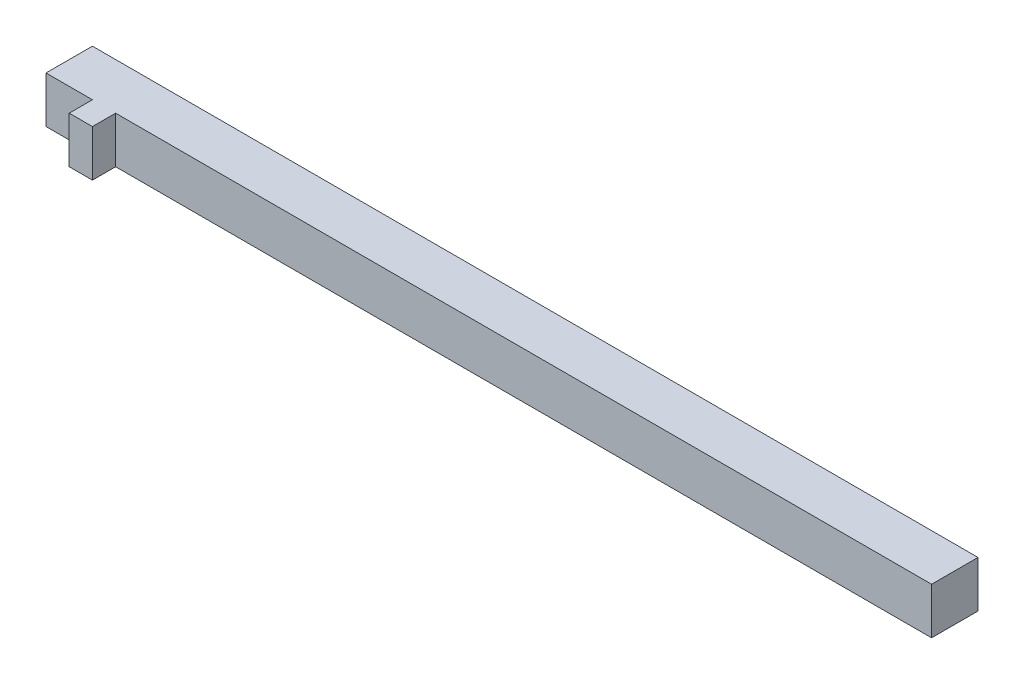
ISO-10303-21;
HEADER;
FILE_DESCRIPTION(('STEP AP214'),'2;1');
FILE_NAME('part.step','',(''),(''),'','','');
FILE_SCHEMA(('AUTOMOTIVE_DESIGN { 1 0 10303 214 1 1 1 1 }'));
ENDSEC;
DATA;
#1=APPLICATION_CONTEXT('core data for automotive mechanical design processes');
#2=APPLICATION_PROTOCOL_DEFINITION('international standard','automotive_design',2000,#1);
#3=PRODUCT_CONTEXT('',#1,'mechanical');
#4=PRODUCT('Part','Part','',(#3));
#5=PRODUCT_RELATED_PRODUCT_CATEGORY('part','',(#4));
#6=PRODUCT_DEFINITION_FORMATION('','',#4);
#7=PRODUCT_DEFINITION_CONTEXT('part definition',#1,'design');
#8=PRODUCT_DEFINITION('design','',#6,#7);
#9=PRODUCT_DEFINITION_SHAPE('','',#8);
#10=(LENGTH_UNIT() NAMED_UNIT(*) SI_UNIT(.MILLI.,.METRE.));
#11=(NAMED_UNIT(*) PLANE_ANGLE_UNIT() SI_UNIT($,.RADIAN.));
#12=(NAMED_UNIT(*) SI_UNIT($,.STERADIAN.) SOLID_ANGLE_UNIT());
#13=UNCERTAINTY_MEASURE_WITH_UNIT(LENGTH_MEASURE(1.E-05),#10,'distance_accuracy_value','');
#14=(GEOMETRIC_REPRESENTATION_CONTEXT(3) GLOBAL_UNCERTAINTY_ASSIGNED_CONTEXT((#13)) GLOBAL_UNIT_ASSIGNED_CONTEXT((#10,
#11,#12)) REPRESENTATION_CONTEXT('',''));
#15=CARTESIAN_POINT('',(0.,0.,0.));
#16=DIRECTION('',(0.,0.,1.));
#17=DIRECTION('',(1.,0.,0.));
#18=AXIS2_PLACEMENT_3D('',#15,#16,#17);
#19=CARTESIAN_POINT('',(0.,0.,200.));
#20=DIRECTION('',(0.,0.,1.));
#21=DIRECTION('',(1.,0.,0.));
#22=AXIS2_PLACEMENT_3D('',#19,#20,#21);
#23=PLANE('',#22);
#24=DIRECTION('',(0.,-1.,0.));
#25=VECTOR('',#24,1.);
#26=CARTESIAN_POINT('',(-1707.5,-100.,200.));
#27=LINE('',#26,#25);
#28=CARTESIAN_POINT('',(-1707.5,99.9999999999998,200.));
#29=VERTEX_POINT('',#28);
#30=CARTESIAN_POINT('',(-1707.5,-100.,200.));
#31=VERTEX_POINT('',#30);
#32=EDGE_CURVE('E55',#29,#31,#27,.T.);
#33=ORIENTED_EDGE('',*,*,#32,.F.);
#34=DIRECTION('',(-1.,0.,0.));
#35=VECTOR('',#34,1.);
#36=CARTESIAN_POINT('',(1907.5,100.,200.));
#37=LINE('',#36,#35);
#38=CARTESIAN_POINT('',(-1907.5,99.9999999999998,200.));
#39=VERTEX_POINT('',#38);
#40=EDGE_CURVE('E152',#29,#39,#37,.T.);
#41=ORIENTED_EDGE('',*,*,#40,.T.);
#42=DIRECTION('',(0.,-1.,0.));
#43=VECTOR('',#42,1.);
#44=CARTESIAN_POINT('',(-1907.5,-100.,200.));
#45=LINE('',#44,#43);
#46=CARTESIAN_POINT('',(-1907.5,-100.,200.));
#47=VERTEX_POINT('',#46);
#48=EDGE_CURVE('E140',#39,#47,#45,.T.);
#49=ORIENTED_EDGE('',*,*,#48,.T.);
#50=DIRECTION('',(1.,0.,0.));
#51=VECTOR('',#50,1.);
#52=CARTESIAN_POINT('',(1907.5,-99.9999999999998,200.));
#53=LINE('',#52,#51);
#54=EDGE_CURVE('E146',#47,#31,#53,.T.);
#55=ORIENTED_EDGE('',*,*,#54,.T.);
#56=EDGE_LOOP('',(#33,#41,#49,#55));
#57=FACE_BOUND('',#56,.T.);
#58=ADVANCED_FACE('F39',(#57),#23,.T.);
#59=CARTESIAN_POINT('',(-1907.5,-100.,200.));
#60=DIRECTION('',(1.,0.,0.));
#61=DIRECTION('',(0.,0.,-1.));
#62=AXIS2_PLACEMENT_3D('',#59,#60,#61);
#63=PLANE('',#62);
#64=DIRECTION('',(0.,-1.,0.));
#65=VECTOR('',#64,1.);
#66=CARTESIAN_POINT('',(-1907.5,-100.,0.));
#67=LINE('',#66,#65);
#68=CARTESIAN_POINT('',(-1907.5,99.9999999999998,0.));
#69=VERTEX_POINT('',#68);
#70=CARTESIAN_POINT('',(-1907.5,-100.,0.));
#71=VERTEX_POINT('',#70);
#72=EDGE_CURVE('E129',#69,#71,#67,.T.);
#73=ORIENTED_EDGE('',*,*,#72,.T.);
#74=DIRECTION('',(0.,0.,-1.));
#75=VECTOR('',#74,1.);
#76=CARTESIAN_POINT('',(-1907.5,-100.,200.));
#77=LINE('',#76,#75);
#78=EDGE_CURVE('E11',#47,#71,#77,.T.);
#79=ORIENTED_EDGE('',*,*,#78,.F.);
#80=ORIENTED_EDGE('',*,*,#48,.F.);
#81=DIRECTION('',(0.,0.,-1.));
#82=VECTOR('',#81,1.);
#83=CARTESIAN_POINT('',(-1907.5,99.9999999999998,200.));
#84=LINE('',#83,#82);
#85=EDGE_CURVE('E155',#39,#69,#84,.T.);
#86=ORIENTED_EDGE('',*,*,#85,.T.);
#87=EDGE_LOOP('',(#73,#79,#80,#86));
#88=FACE_BOUND('',#87,.T.);
#89=ADVANCED_FACE('F41',(#88),#63,.F.);
#90=CARTESIAN_POINT('',(1907.5,-99.9999999999998,200.));
#91=DIRECTION('',(0.,1.,0.));
#92=DIRECTION('',(-1.,0.,0.));
#93=AXIS2_PLACEMENT_3D('',#90,#91,#92);
#94=PLANE('',#93);
#95=DIRECTION('',(1.,0.,0.));
#96=VECTOR('',#95,1.);
#97=CARTESIAN_POINT('',(1907.5,-99.9999999999998,0.));
#98=LINE('',#97,#96);
#99=CARTESIAN_POINT('',(1907.5,-99.9999999999998,0.));
#100=VERTEX_POINT('',#99);
#101=EDGE_CURVE('E134',#71,#100,#98,.T.);
#102=ORIENTED_EDGE('',*,*,#101,.T.);
#103=DIRECTION('',(0.,0.,-1.));
#104=VECTOR('',#103,1.);
#105=CARTESIAN_POINT('',(1907.5,-99.9999999999998,200.));
#106=LINE('',#105,#104);
#107=CARTESIAN_POINT('',(1907.5,-99.9999999999998,200.));
#108=VERTEX_POINT('',#107);
#109=EDGE_CURVE('E48',#108,#100,#106,.T.);
#110=ORIENTED_EDGE('',*,*,#109,.F.);
#111=CARTESIAN_POINT('',(-1607.5,-100.,200.));
#112=VERTEX_POINT('',#111);
#113=EDGE_CURVE('E144',#112,#108,#53,.T.);
#114=ORIENTED_EDGE('',*,*,#113,.F.);
#115=DIRECTION('',(0.,0.,-1.));
#116=VECTOR('',#115,1.);
#117=CARTESIAN_POINT('',(-1607.5,-100.,300.));
#118=LINE('',#117,#116);
#119=CARTESIAN_POINT('',(-1607.5,-100.,300.));
#120=VERTEX_POINT('',#119);
#121=EDGE_CURVE('E111',#120,#112,#118,.T.);
#122=ORIENTED_EDGE('',*,*,#121,.F.);
#123=DIRECTION('',(1.,0.,0.));
#124=VECTOR('',#123,1.);
#125=CARTESIAN_POINT('',(-1707.5,-100.,300.));
#126=LINE('',#125,#124);
#127=CARTESIAN_POINT('',(-1707.5,-100.,300.));
#128=VERTEX_POINT('',#127);
#129=EDGE_CURVE('E105',#128,#120,#126,.T.);
#130=ORIENTED_EDGE('',*,*,#129,.F.);
#131=DIRECTION('',(0.,0.,-1.));
#132=VECTOR('',#131,1.);
#133=CARTESIAN_POINT('',(-1707.5,-100.,300.));
#134=LINE('',#133,#132);
#135=EDGE_CURVE('E109',#128,#31,#134,.T.);
#136=ORIENTED_EDGE('',*,*,#135,.T.);
#137=ORIENTED_EDGE('',*,*,#54,.F.);
#138=ORIENTED_EDGE('',*,*,#78,.T.);
#139=EDGE_LOOP('',(#102,#110,#114,#122,#130,#136,#137,#138));
#140=FACE_BOUND('',#139,.T.);
#141=ADVANCED_FACE('F107',(#140),#94,.F.);
#142=CARTESIAN_POINT('',(1907.5,-99.9999999999998,200.));
#143=DIRECTION('',(-1.,0.,0.));
#144=DIRECTION('',(0.,0.,1.));
#145=AXIS2_PLACEMENT_3D('',#142,#143,#144);
#146=PLANE('',#145);
#147=DIRECTION('',(0.,1.,0.));
#148=VECTOR('',#147,1.);
#149=CARTESIAN_POINT('',(1907.5,-99.9999999999998,0.));
#150=LINE('',#149,#148);
#151=CARTESIAN_POINT('',(1907.5,100.,0.));
#152=VERTEX_POINT('',#151);
#153=EDGE_CURVE('E159',#100,#152,#150,.T.);
#154=ORIENTED_EDGE('',*,*,#153,.T.);
#155=DIRECTION('',(0.,0.,-1.));
#156=VECTOR('',#155,1.);
#157=CARTESIAN_POINT('',(1907.5,100.,200.));
#158=LINE('',#157,#156);
#159=CARTESIAN_POINT('',(1907.5,100.,200.));
#160=VERTEX_POINT('',#159);
#161=EDGE_CURVE('E167',#160,#152,#158,.T.);
#162=ORIENTED_EDGE('',*,*,#161,.F.);
#163=DIRECTION('',(0.,1.,0.));
#164=VECTOR('',#163,1.);
#165=CARTESIAN_POINT('',(1907.5,-99.9999999999998,200.));
#166=LINE('',#165,#164);
#167=EDGE_CURVE('E149',#108,#160,#166,.T.);
#168=ORIENTED_EDGE('',*,*,#167,.F.);
#169=ORIENTED_EDGE('',*,*,#109,.T.);
#170=EDGE_LOOP('',(#154,#162,#168,#169));
#171=FACE_BOUND('',#170,.T.);
#172=ADVANCED_FACE('F176',(#171),#146,.F.);
#173=CARTESIAN_POINT('',(1907.5,100.,200.));
#174=DIRECTION('',(0.,-1.,0.));
#175=DIRECTION('',(1.,0.,0.));
#176=AXIS2_PLACEMENT_3D('',#173,#174,#175);
#177=PLANE('',#176);
#178=DIRECTION('',(-1.,0.,0.));
#179=VECTOR('',#178,1.);
#180=CARTESIAN_POINT('',(1907.5,100.,0.));
#181=LINE('',#180,#179);
#182=EDGE_CURVE('E145',#152,#69,#181,.T.);
#183=ORIENTED_EDGE('',*,*,#182,.T.);
#184=ORIENTED_EDGE('',*,*,#85,.F.);
#185=ORIENTED_EDGE('',*,*,#40,.F.);
#186=DIRECTION('',(0.,0.,-1.));
#187=VECTOR('',#186,1.);
#188=CARTESIAN_POINT('',(-1707.5,100.,300.));
#189=LINE('',#188,#187);
#190=CARTESIAN_POINT('',(-1707.5,100.,300.));
#191=VERTEX_POINT('',#190);
#192=EDGE_CURVE('E199',#191,#29,#189,.T.);
#193=ORIENTED_EDGE('',*,*,#192,.F.);
#194=DIRECTION('',(-1.,0.,0.));
#195=VECTOR('',#194,1.);
#196=CARTESIAN_POINT('',(-1707.5,100.,300.));
#197=LINE('',#196,#195);
#198=CARTESIAN_POINT('',(-1607.5,100.,300.));
#199=VERTEX_POINT('',#198);
#200=EDGE_CURVE('E121',#199,#191,#197,.T.);
#201=ORIENTED_EDGE('',*,*,#200,.F.);
#202=DIRECTION('',(0.,0.,-1.));
#203=VECTOR('',#202,1.);
#204=CARTESIAN_POINT('',(-1607.5,100.,300.));
#205=LINE('',#204,#203);
#206=CARTESIAN_POINT('',(-1607.5,100.,200.));
#207=VERTEX_POINT('',#206);
#208=EDGE_CURVE('E136',#199,#207,#205,.T.);
#209=ORIENTED_EDGE('',*,*,#208,.T.);
#210=EDGE_CURVE('E153',#160,#207,#37,.T.);
#211=ORIENTED_EDGE('',*,*,#210,.F.);
#212=ORIENTED_EDGE('',*,*,#161,.T.);
#213=EDGE_LOOP('',(#183,#184,#185,#193,#201,#209,#211,#212));
#214=FACE_BOUND('',#213,.T.);
#215=ADVANCED_FACE('F184',(#214),#177,.F.);
#216=DIRECTION('',(0.,1.,0.));
#217=VECTOR('',#216,1.);
#218=CARTESIAN_POINT('',(-1607.5,-100.,200.));
#219=LINE('',#218,#217);
#220=EDGE_CURVE('E63',#112,#207,#219,.T.);
#221=ORIENTED_EDGE('',*,*,#220,.F.);
#222=ORIENTED_EDGE('',*,*,#113,.T.);
#223=ORIENTED_EDGE('',*,*,#167,.T.);
#224=ORIENTED_EDGE('',*,*,#210,.T.);
#225=EDGE_LOOP('',(#221,#222,#223,#224));
#226=FACE_BOUND('',#225,.T.);
#227=ADVANCED_FACE('F191',(#226),#23,.T.);
#228=CARTESIAN_POINT('',(0.,0.,0.));
#229=DIRECTION('',(0.,0.,1.));
#230=DIRECTION('',(1.,0.,0.));
#231=AXIS2_PLACEMENT_3D('',#228,#229,#230);
#232=PLANE('',#231);
#233=ORIENTED_EDGE('',*,*,#72,.F.);
#234=ORIENTED_EDGE('',*,*,#182,.F.);
#235=ORIENTED_EDGE('',*,*,#153,.F.);
#236=ORIENTED_EDGE('',*,*,#101,.F.);
#237=EDGE_LOOP('',(#233,#234,#235,#236));
#238=FACE_BOUND('',#237,.T.);
#239=ADVANCED_FACE('F181',(#238),#232,.F.);
#240=CARTESIAN_POINT('',(-1707.5,-100.,300.));
#241=DIRECTION('',(1.,0.,0.));
#242=DIRECTION('',(0.,0.,-1.));
#243=AXIS2_PLACEMENT_3D('',#240,#241,#242);
#244=PLANE('',#243);
#245=ORIENTED_EDGE('',*,*,#32,.T.);
#246=ORIENTED_EDGE('',*,*,#135,.F.);
#247=DIRECTION('',(0.,-1.,0.));
#248=VECTOR('',#247,1.);
#249=CARTESIAN_POINT('',(-1707.5,-100.,300.));
#250=LINE('',#249,#248);
#251=EDGE_CURVE('E116',#191,#128,#250,.T.);
#252=ORIENTED_EDGE('',*,*,#251,.F.);
#253=ORIENTED_EDGE('',*,*,#192,.T.);
#254=EDGE_LOOP('',(#245,#246,#252,#253));
#255=FACE_BOUND('',#254,.T.);
#256=ADVANCED_FACE('F127',(#255),#244,.F.);
#257=CARTESIAN_POINT('',(-1607.5,-100.,300.));
#258=DIRECTION('',(-1.,0.,0.));
#259=DIRECTION('',(0.,0.,1.));
#260=AXIS2_PLACEMENT_3D('',#257,#258,#259);
#261=PLANE('',#260);
#262=ORIENTED_EDGE('',*,*,#220,.T.);
#263=ORIENTED_EDGE('',*,*,#208,.F.);
#264=DIRECTION('',(0.,1.,0.));
#265=VECTOR('',#264,1.);
#266=CARTESIAN_POINT('',(-1607.5,-100.,300.));
#267=LINE('',#266,#265);
#268=EDGE_CURVE('E115',#120,#199,#267,.T.);
#269=ORIENTED_EDGE('',*,*,#268,.F.);
#270=ORIENTED_EDGE('',*,*,#121,.T.);
#271=EDGE_LOOP('',(#262,#263,#269,#270));
#272=FACE_BOUND('',#271,.T.);
#273=ADVANCED_FACE('F193',(#272),#261,.F.);
#274=CARTESIAN_POINT('',(0.,0.,300.));
#275=DIRECTION('',(0.,0.,-1.));
#276=DIRECTION('',(-1.,0.,0.));
#277=AXIS2_PLACEMENT_3D('',#274,#275,#276);
#278=PLANE('',#277);
#279=ORIENTED_EDGE('',*,*,#251,.T.);
#280=ORIENTED_EDGE('',*,*,#129,.T.);
#281=ORIENTED_EDGE('',*,*,#268,.T.);
#282=ORIENTED_EDGE('',*,*,#200,.T.);
#283=EDGE_LOOP('',(#279,#280,#281,#282));
#284=FACE_BOUND('',#283,.T.);
#285=ADVANCED_FACE('F119',(#284),#278,.F.);
#286=CLOSED_SHELL('',(#58,#89,#141,#172,#215,#227,#239,#256,#273,#285));
#287=MANIFOLD_SOLID_BREP('B2',#286);
#288=ADVANCED_BREP_SHAPE_REPRESENTATION('',(#18,#287),#14);
#289=SHAPE_DEFINITION_REPRESENTATION(#9,#288);
ENDSEC;
END-ISO-10303-21;
